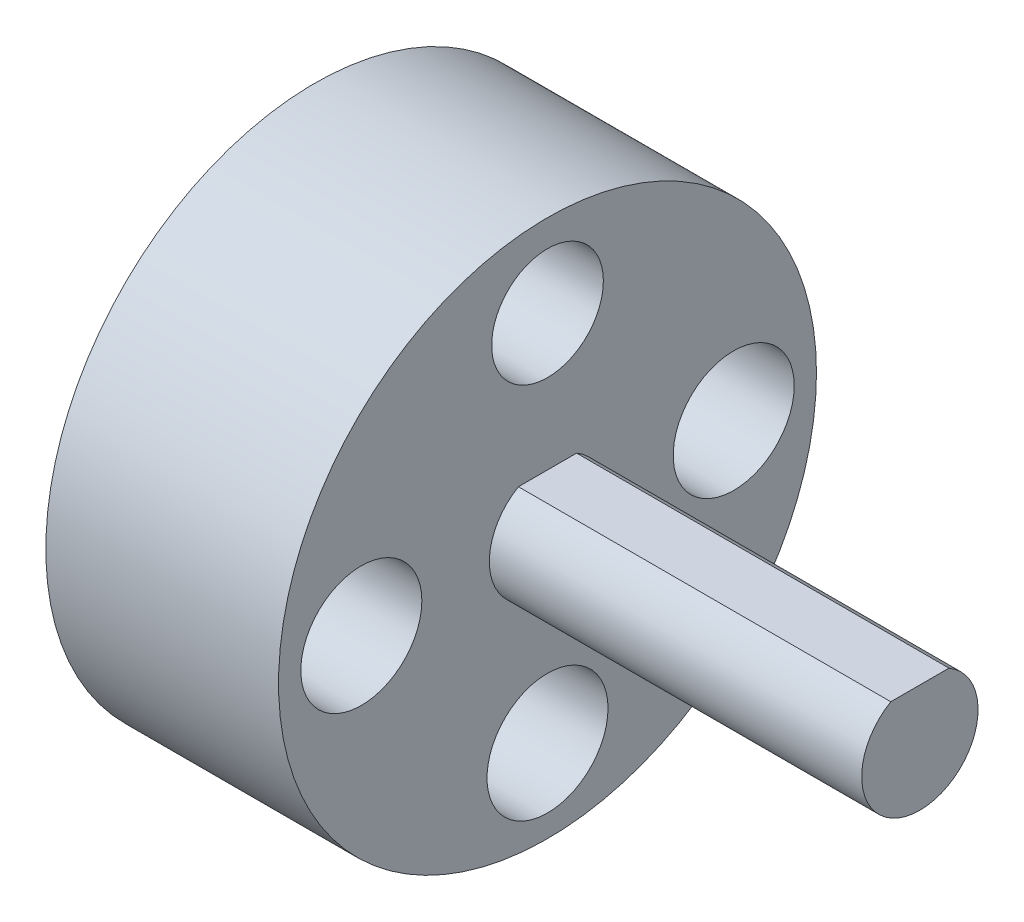
ISO-10303-21;
HEADER;
FILE_DESCRIPTION(('STEP AP214'),'2;1');
FILE_NAME('part.step','',(''),(''),'','','');
FILE_SCHEMA(('AUTOMOTIVE_DESIGN { 1 0 10303 214 1 1 1 1 }'));
ENDSEC;
DATA;
#1=APPLICATION_CONTEXT('core data for automotive mechanical design processes');
#2=APPLICATION_PROTOCOL_DEFINITION('international standard','automotive_design',2000,#1);
#3=PRODUCT_CONTEXT('',#1,'mechanical');
#4=PRODUCT('Part','Part','',(#3));
#5=PRODUCT_RELATED_PRODUCT_CATEGORY('part','',(#4));
#6=PRODUCT_DEFINITION_FORMATION('','',#4);
#7=PRODUCT_DEFINITION_CONTEXT('part definition',#1,'design');
#8=PRODUCT_DEFINITION('design','',#6,#7);
#9=PRODUCT_DEFINITION_SHAPE('','',#8);
#10=(LENGTH_UNIT() NAMED_UNIT(*) SI_UNIT(.MILLI.,.METRE.));
#11=(NAMED_UNIT(*) PLANE_ANGLE_UNIT() SI_UNIT($,.RADIAN.));
#12=(NAMED_UNIT(*) SI_UNIT($,.STERADIAN.) SOLID_ANGLE_UNIT());
#13=UNCERTAINTY_MEASURE_WITH_UNIT(LENGTH_MEASURE(1.E-05),#10,'distance_accuracy_value','');
#14=(GEOMETRIC_REPRESENTATION_CONTEXT(3) GLOBAL_UNCERTAINTY_ASSIGNED_CONTEXT((#13)) GLOBAL_UNIT_ASSIGNED_CONTEXT((#10,
#11,#12)) REPRESENTATION_CONTEXT('',''));
#15=CARTESIAN_POINT('',(0.,0.,0.));
#16=DIRECTION('',(0.,0.,1.));
#17=DIRECTION('',(1.,0.,0.));
#18=AXIS2_PLACEMENT_3D('',#15,#16,#17);
#19=CARTESIAN_POINT('',(10.,0.,0.));
#20=DIRECTION('',(1.,0.,0.));
#21=DIRECTION('',(0.,0.,-1.));
#22=AXIS2_PLACEMENT_3D('',#19,#20,#21);
#23=PLANE('',#22);
#24=CARTESIAN_POINT('',(10.,8.00000000000002,0.));
#25=DIRECTION('',(1.,0.,0.));
#26=DIRECTION('',(0.,0.,-1.));
#27=AXIS2_PLACEMENT_3D('',#24,#25,#26);
#28=CIRCLE('',#27,2.4);
#29=CARTESIAN_POINT('',(10.,8.00000000000002,-2.39999999999998));
#30=VERTEX_POINT('',#29);
#31=EDGE_CURVE('E11',#30,#30,#28,.T.);
#32=ORIENTED_EDGE('',*,*,#31,.F.);
#33=EDGE_LOOP('',(#32));
#34=FACE_BOUND('',#33,.T.);
#35=CARTESIAN_POINT('',(10.,0.,0.));
#36=DIRECTION('',(1.,0.,0.));
#37=DIRECTION('',(0.,0.,-1.));
#38=AXIS2_PLACEMENT_3D('',#35,#36,#37);
#39=CIRCLE('',#38,11.557);
#40=CARTESIAN_POINT('',(10.,0.,-11.557));
#41=VERTEX_POINT('',#40);
#42=EDGE_CURVE('E46',#41,#41,#39,.T.);
#43=ORIENTED_EDGE('',*,*,#42,.T.);
#44=EDGE_LOOP('',(#43));
#45=FACE_BOUND('',#44,.T.);
#46=CARTESIAN_POINT('',(10.,0.,-7.99999999999999));
#47=DIRECTION('',(1.,0.,0.));
#48=DIRECTION('',(0.,0.,-1.));
#49=AXIS2_PLACEMENT_3D('',#46,#47,#48);
#50=CIRCLE('',#49,2.6);
#51=CARTESIAN_POINT('',(10.,0.,-10.6));
#52=VERTEX_POINT('',#51);
#53=EDGE_CURVE('E91',#52,#52,#50,.T.);
#54=ORIENTED_EDGE('',*,*,#53,.F.);
#55=EDGE_LOOP('',(#54));
#56=FACE_BOUND('',#55,.T.);
#57=CARTESIAN_POINT('',(10.,-7.99999999999998,0.));
#58=DIRECTION('',(1.,0.,0.));
#59=DIRECTION('',(0.,0.,-1.));
#60=AXIS2_PLACEMENT_3D('',#57,#58,#59);
#61=CIRCLE('',#60,2.6);
#62=CARTESIAN_POINT('',(10.,-7.99999999999998,-2.60000000000001));
#63=VERTEX_POINT('',#62);
#64=EDGE_CURVE('E88',#63,#63,#61,.T.);
#65=ORIENTED_EDGE('',*,*,#64,.F.);
#66=EDGE_LOOP('',(#65));
#67=FACE_BOUND('',#66,.T.);
#68=CARTESIAN_POINT('',(10.,0.,8.00000000000001));
#69=DIRECTION('',(1.,0.,0.));
#70=DIRECTION('',(0.,0.,-1.));
#71=AXIS2_PLACEMENT_3D('',#68,#69,#70);
#72=CIRCLE('',#71,2.6);
#73=CARTESIAN_POINT('',(10.,0.,5.4));
#74=VERTEX_POINT('',#73);
#75=EDGE_CURVE('E85',#74,#74,#72,.T.);
#76=ORIENTED_EDGE('',*,*,#75,.F.);
#77=EDGE_LOOP('',(#76));
#78=FACE_BOUND('',#77,.T.);
#79=DIRECTION('',(0.,0.,-1.));
#80=VECTOR('',#79,1.);
#81=CARTESIAN_POINT('',(10.,2.1650635094611,0.));
#82=LINE('',#81,#80);
#83=CARTESIAN_POINT('',(10.,2.1650635094611,1.25));
#84=VERTEX_POINT('',#83);
#85=CARTESIAN_POINT('',(10.,2.1650635094611,-1.25));
#86=VERTEX_POINT('',#85);
#87=EDGE_CURVE('E54',#84,#86,#82,.T.);
#88=ORIENTED_EDGE('',*,*,#87,.T.);
#89=CARTESIAN_POINT('',(10.,0.,0.));
#90=DIRECTION('',(1.,0.,0.));
#91=DIRECTION('',(0.,0.,-1.));
#92=AXIS2_PLACEMENT_3D('',#89,#90,#91);
#93=CIRCLE('',#92,2.5);
#94=EDGE_CURVE('E75',#84,#86,#93,.T.);
#95=ORIENTED_EDGE('',*,*,#94,.F.);
#96=EDGE_LOOP('',(#88,#95));
#97=FACE_BOUND('',#96,.T.);
#98=ADVANCED_FACE('F37',(#34,#45,#56,#67,#78,#97),#23,.T.);
#99=CARTESIAN_POINT('',(10.,0.,0.));
#100=DIRECTION('',(-1.,0.,0.));
#101=DIRECTION('',(0.,0.,1.));
#102=AXIS2_PLACEMENT_3D('',#99,#100,#101);
#103=CYLINDRICAL_SURFACE('',#102,11.557);
#104=ORIENTED_EDGE('',*,*,#42,.F.);
#105=EDGE_LOOP('',(#104));
#106=FACE_BOUND('',#105,.T.);
#107=CARTESIAN_POINT('',(0.,0.,0.));
#108=DIRECTION('',(1.,0.,0.));
#109=DIRECTION('',(0.,0.,-1.));
#110=AXIS2_PLACEMENT_3D('',#107,#108,#109);
#111=CIRCLE('',#110,11.557);
#112=CARTESIAN_POINT('',(0.,0.,-11.557));
#113=VERTEX_POINT('',#112);
#114=EDGE_CURVE('E103',#113,#113,#111,.T.);
#115=ORIENTED_EDGE('',*,*,#114,.T.);
#116=EDGE_LOOP('',(#115));
#117=FACE_BOUND('',#116,.T.);
#118=ADVANCED_FACE('F126',(#106,#117),#103,.T.);
#119=CARTESIAN_POINT('',(10.,0.,-7.99999999999999));
#120=DIRECTION('',(-1.,0.,0.));
#121=DIRECTION('',(0.,0.,1.));
#122=AXIS2_PLACEMENT_3D('',#119,#120,#121);
#123=CYLINDRICAL_SURFACE('',#122,2.6);
#124=ORIENTED_EDGE('',*,*,#53,.T.);
#125=EDGE_LOOP('',(#124));
#126=FACE_BOUND('',#125,.T.);
#127=CARTESIAN_POINT('',(0.,0.,-7.99999999999999));
#128=DIRECTION('',(1.,0.,0.));
#129=DIRECTION('',(0.,0.,-1.));
#130=AXIS2_PLACEMENT_3D('',#127,#128,#129);
#131=CIRCLE('',#130,2.6);
#132=CARTESIAN_POINT('',(0.,0.,-10.6));
#133=VERTEX_POINT('',#132);
#134=EDGE_CURVE('E101',#133,#133,#131,.T.);
#135=ORIENTED_EDGE('',*,*,#134,.F.);
#136=EDGE_LOOP('',(#135));
#137=FACE_BOUND('',#136,.T.);
#138=ADVANCED_FACE('F132',(#126,#137),#123,.F.);
#139=CARTESIAN_POINT('',(10.,-7.99999999999998,0.));
#140=DIRECTION('',(-1.,0.,0.));
#141=DIRECTION('',(0.,0.,1.));
#142=AXIS2_PLACEMENT_3D('',#139,#140,#141);
#143=CYLINDRICAL_SURFACE('',#142,2.6);
#144=ORIENTED_EDGE('',*,*,#64,.T.);
#145=EDGE_LOOP('',(#144));
#146=FACE_BOUND('',#145,.T.);
#147=CARTESIAN_POINT('',(0.,-7.99999999999998,0.));
#148=DIRECTION('',(1.,0.,0.));
#149=DIRECTION('',(0.,0.,-1.));
#150=AXIS2_PLACEMENT_3D('',#147,#148,#149);
#151=CIRCLE('',#150,2.6);
#152=CARTESIAN_POINT('',(0.,-7.99999999999998,-2.60000000000001));
#153=VERTEX_POINT('',#152);
#154=EDGE_CURVE('E98',#153,#153,#151,.T.);
#155=ORIENTED_EDGE('',*,*,#154,.F.);
#156=EDGE_LOOP('',(#155));
#157=FACE_BOUND('',#156,.T.);
#158=ADVANCED_FACE('F122',(#146,#157),#143,.F.);
#159=CARTESIAN_POINT('',(10.,0.,8.00000000000001));
#160=DIRECTION('',(-1.,0.,0.));
#161=DIRECTION('',(0.,0.,1.));
#162=AXIS2_PLACEMENT_3D('',#159,#160,#161);
#163=CYLINDRICAL_SURFACE('',#162,2.6);
#164=ORIENTED_EDGE('',*,*,#75,.T.);
#165=EDGE_LOOP('',(#164));
#166=FACE_BOUND('',#165,.T.);
#167=CARTESIAN_POINT('',(0.,0.,8.00000000000001));
#168=DIRECTION('',(1.,0.,0.));
#169=DIRECTION('',(0.,0.,-1.));
#170=AXIS2_PLACEMENT_3D('',#167,#168,#169);
#171=CIRCLE('',#170,2.6);
#172=CARTESIAN_POINT('',(0.,0.,5.4));
#173=VERTEX_POINT('',#172);
#174=EDGE_CURVE('E84',#173,#173,#171,.T.);
#175=ORIENTED_EDGE('',*,*,#174,.F.);
#176=EDGE_LOOP('',(#175));
#177=FACE_BOUND('',#176,.T.);
#178=ADVANCED_FACE('F39',(#166,#177),#163,.F.);
#179=CARTESIAN_POINT('',(10.,8.00000000000002,0.));
#180=DIRECTION('',(-1.,0.,0.));
#181=DIRECTION('',(0.,0.,1.));
#182=AXIS2_PLACEMENT_3D('',#179,#180,#181);
#183=CYLINDRICAL_SURFACE('',#182,2.4);
#184=ORIENTED_EDGE('',*,*,#31,.T.);
#185=EDGE_LOOP('',(#184));
#186=FACE_BOUND('',#185,.T.);
#187=CARTESIAN_POINT('',(0.,8.00000000000002,0.));
#188=DIRECTION('',(1.,0.,0.));
#189=DIRECTION('',(0.,0.,-1.));
#190=AXIS2_PLACEMENT_3D('',#187,#188,#189);
#191=CIRCLE('',#190,2.4);
#192=CARTESIAN_POINT('',(0.,8.00000000000002,-2.39999999999998));
#193=VERTEX_POINT('',#192);
#194=EDGE_CURVE('E41',#193,#193,#191,.T.);
#195=ORIENTED_EDGE('',*,*,#194,.F.);
#196=EDGE_LOOP('',(#195));
#197=FACE_BOUND('',#196,.T.);
#198=ADVANCED_FACE('F112',(#186,#197),#183,.F.);
#199=CARTESIAN_POINT('',(0.,0.,0.));
#200=DIRECTION('',(1.,0.,0.));
#201=DIRECTION('',(0.,0.,-1.));
#202=AXIS2_PLACEMENT_3D('',#199,#200,#201);
#203=PLANE('',#202);
#204=ORIENTED_EDGE('',*,*,#174,.T.);
#205=EDGE_LOOP('',(#204));
#206=FACE_BOUND('',#205,.T.);
#207=ORIENTED_EDGE('',*,*,#154,.T.);
#208=EDGE_LOOP('',(#207));
#209=FACE_BOUND('',#208,.T.);
#210=ORIENTED_EDGE('',*,*,#134,.T.);
#211=EDGE_LOOP('',(#210));
#212=FACE_BOUND('',#211,.T.);
#213=ORIENTED_EDGE('',*,*,#114,.F.);
#214=EDGE_LOOP('',(#213));
#215=FACE_BOUND('',#214,.T.);
#216=ORIENTED_EDGE('',*,*,#194,.T.);
#217=EDGE_LOOP('',(#216));
#218=FACE_BOUND('',#217,.T.);
#219=ADVANCED_FACE('F110',(#206,#209,#212,#215,#218),#203,.F.);
#220=CARTESIAN_POINT('',(26.,2.1650635094611,0.));
#221=DIRECTION('',(0.,1.,0.));
#222=DIRECTION('',(0.,0.,1.));
#223=AXIS2_PLACEMENT_3D('',#220,#221,#222);
#224=PLANE('',#223);
#225=ORIENTED_EDGE('',*,*,#87,.F.);
#226=DIRECTION('',(-1.,0.,0.));
#227=VECTOR('',#226,1.);
#228=CARTESIAN_POINT('',(26.,2.1650635094611,1.25));
#229=LINE('',#228,#227);
#230=CARTESIAN_POINT('',(26.,2.1650635094611,1.25));
#231=VERTEX_POINT('',#230);
#232=EDGE_CURVE('E72',#231,#84,#229,.T.);
#233=ORIENTED_EDGE('',*,*,#232,.F.);
#234=DIRECTION('',(0.,0.,-1.));
#235=VECTOR('',#234,1.);
#236=CARTESIAN_POINT('',(26.,2.1650635094611,0.));
#237=LINE('',#236,#235);
#238=CARTESIAN_POINT('',(26.,2.1650635094611,-1.25));
#239=VERTEX_POINT('',#238);
#240=EDGE_CURVE('E70',#231,#239,#237,.T.);
#241=ORIENTED_EDGE('',*,*,#240,.T.);
#242=DIRECTION('',(-1.,0.,0.));
#243=VECTOR('',#242,1.);
#244=CARTESIAN_POINT('',(26.,2.1650635094611,-1.25));
#245=LINE('',#244,#243);
#246=EDGE_CURVE('E67',#239,#86,#245,.T.);
#247=ORIENTED_EDGE('',*,*,#246,.T.);
#248=EDGE_LOOP('',(#225,#233,#241,#247));
#249=FACE_BOUND('',#248,.T.);
#250=ADVANCED_FACE('F69',(#249),#224,.T.);
#251=CARTESIAN_POINT('',(26.,0.,0.));
#252=DIRECTION('',(-1.,0.,0.));
#253=DIRECTION('',(0.,0.,1.));
#254=AXIS2_PLACEMENT_3D('',#251,#252,#253);
#255=CYLINDRICAL_SURFACE('',#254,2.5);
#256=ORIENTED_EDGE('',*,*,#94,.T.);
#257=ORIENTED_EDGE('',*,*,#246,.F.);
#258=CARTESIAN_POINT('',(26.,0.,0.));
#259=DIRECTION('',(1.,0.,0.));
#260=DIRECTION('',(0.,0.,-1.));
#261=AXIS2_PLACEMENT_3D('',#258,#259,#260);
#262=CIRCLE('',#261,2.5);
#263=EDGE_CURVE('E62',#231,#239,#262,.T.);
#264=ORIENTED_EDGE('',*,*,#263,.F.);
#265=ORIENTED_EDGE('',*,*,#232,.T.);
#266=EDGE_LOOP('',(#256,#257,#264,#265));
#267=FACE_BOUND('',#266,.T.);
#268=ADVANCED_FACE('F76',(#267),#255,.T.);
#269=CARTESIAN_POINT('',(26.,0.,0.));
#270=DIRECTION('',(1.,0.,0.));
#271=DIRECTION('',(0.,0.,-1.));
#272=AXIS2_PLACEMENT_3D('',#269,#270,#271);
#273=PLANE('',#272);
#274=ORIENTED_EDGE('',*,*,#240,.F.);
#275=ORIENTED_EDGE('',*,*,#263,.T.);
#276=EDGE_LOOP('',(#274,#275));
#277=FACE_BOUND('',#276,.T.);
#278=ADVANCED_FACE('F141',(#277),#273,.T.);
#279=CLOSED_SHELL('',(#98,#118,#138,#158,#178,#198,#219,#250,#268,#278));
#280=MANIFOLD_SOLID_BREP('B2',#279);
#281=ADVANCED_BREP_SHAPE_REPRESENTATION('',(#18,#280),#14);
#282=SHAPE_DEFINITION_REPRESENTATION(#9,#281);
ENDSEC;
END-ISO-10303-21;
